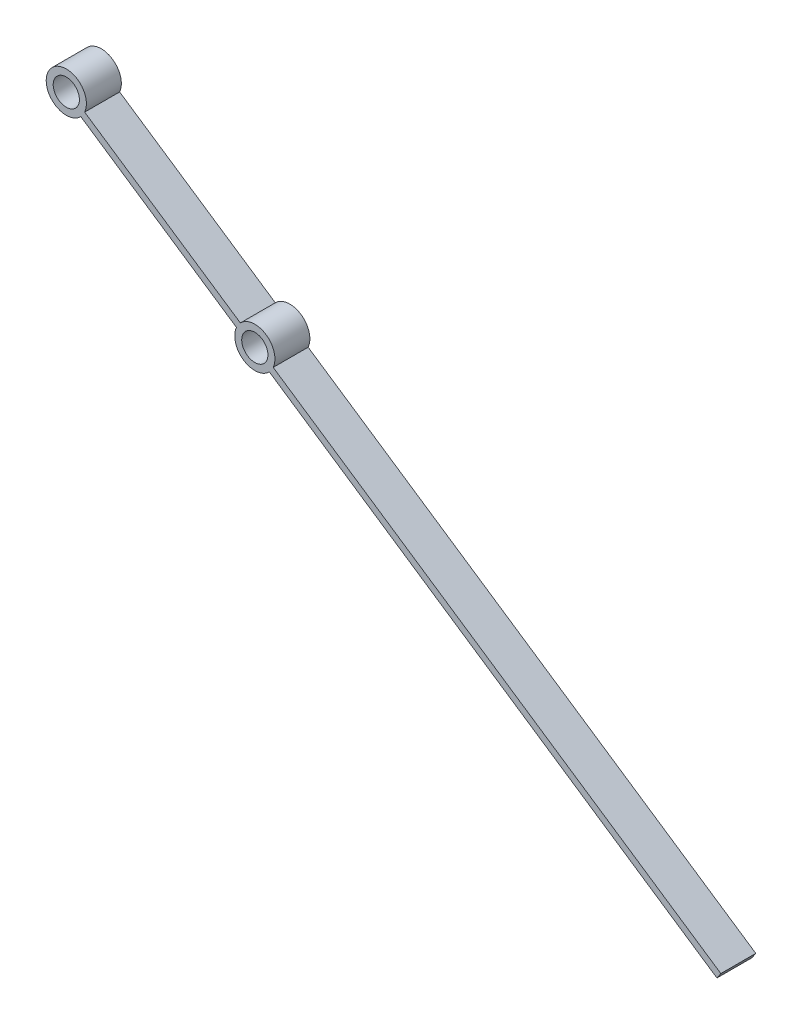
ISO-10303-21;
HEADER;
FILE_DESCRIPTION(('STEP AP214'),'2;1');
FILE_NAME('part.step','',(''),(''),'','','');
FILE_SCHEMA(('AUTOMOTIVE_DESIGN { 1 0 10303 214 1 1 1 1 }'));
ENDSEC;
DATA;
#1=APPLICATION_CONTEXT('core data for automotive mechanical design processes');
#2=APPLICATION_PROTOCOL_DEFINITION('international standard','automotive_design',2000,#1);
#3=PRODUCT_CONTEXT('',#1,'mechanical');
#4=PRODUCT('Part','Part','',(#3));
#5=PRODUCT_RELATED_PRODUCT_CATEGORY('part','',(#4));
#6=PRODUCT_DEFINITION_FORMATION('','',#4);
#7=PRODUCT_DEFINITION_CONTEXT('part definition',#1,'design');
#8=PRODUCT_DEFINITION('design','',#6,#7);
#9=PRODUCT_DEFINITION_SHAPE('','',#8);
#10=(LENGTH_UNIT() NAMED_UNIT(*) SI_UNIT(.MILLI.,.METRE.));
#11=(NAMED_UNIT(*) PLANE_ANGLE_UNIT() SI_UNIT($,.RADIAN.));
#12=(NAMED_UNIT(*) SI_UNIT($,.STERADIAN.) SOLID_ANGLE_UNIT());
#13=UNCERTAINTY_MEASURE_WITH_UNIT(LENGTH_MEASURE(1.E-05),#10,'distance_accuracy_value','');
#14=(GEOMETRIC_REPRESENTATION_CONTEXT(3) GLOBAL_UNCERTAINTY_ASSIGNED_CONTEXT((#13)) GLOBAL_UNIT_ASSIGNED_CONTEXT((#10,
#11,#12)) REPRESENTATION_CONTEXT('',''));
#15=CARTESIAN_POINT('',(0.,0.,0.));
#16=DIRECTION('',(0.,0.,1.));
#17=DIRECTION('',(1.,0.,0.));
#18=AXIS2_PLACEMENT_3D('',#15,#16,#17);
#19=CARTESIAN_POINT('',(-163.126236957769,-95.5245066159686,0.));
#20=DIRECTION('',(0.,0.,1.));
#21=DIRECTION('',(1.,0.,0.));
#22=AXIS2_PLACEMENT_3D('',#19,#20,#21);
#23=CYLINDRICAL_SURFACE('',#22,5.75000000000001);
#24=CARTESIAN_POINT('',(-163.126236957769,-95.5245066159686,0.));
#25=DIRECTION('',(0.,0.,1.));
#26=DIRECTION('',(1.,0.,0.));
#27=AXIS2_PLACEMENT_3D('',#24,#25,#26);
#28=CIRCLE('',#27,5.75000000000001);
#29=CARTESIAN_POINT('',(-168.382718756471,-93.1938631211545,0.));
#30=VERTEX_POINT('',#29);
#31=CARTESIAN_POINT('',(-158.986032584176,-99.5146454287014,0.));
#32=VERTEX_POINT('',#31);
#33=EDGE_CURVE('E132',#30,#32,#28,.T.);
#34=ORIENTED_EDGE('',*,*,#33,.T.);
#35=DIRECTION('',(0.,0.,1.));
#36=VECTOR('',#35,1.);
#37=CARTESIAN_POINT('',(-158.986032584176,-99.5146454287014,0.));
#38=LINE('',#37,#36);
#39=CARTESIAN_POINT('',(-158.986032584176,-99.5146454287014,10.));
#40=VERTEX_POINT('',#39);
#41=EDGE_CURVE('E11',#32,#40,#38,.T.);
#42=ORIENTED_EDGE('',*,*,#41,.T.);
#43=CARTESIAN_POINT('',(-163.126236957769,-95.5245066159686,10.));
#44=DIRECTION('',(0.,0.,1.));
#45=DIRECTION('',(1.,0.,0.));
#46=AXIS2_PLACEMENT_3D('',#43,#44,#45);
#47=CIRCLE('',#46,5.75000000000001);
#48=CARTESIAN_POINT('',(-168.382718756471,-93.1938631211545,10.));
#49=VERTEX_POINT('',#48);
#50=EDGE_CURVE('E135',#49,#40,#47,.T.);
#51=ORIENTED_EDGE('',*,*,#50,.F.);
#52=DIRECTION('',(0.,0.,1.));
#53=VECTOR('',#52,1.);
#54=CARTESIAN_POINT('',(-168.382718756471,-93.1938631211545,0.));
#55=LINE('',#54,#53);
#56=EDGE_CURVE('E138',#30,#49,#55,.T.);
#57=ORIENTED_EDGE('',*,*,#56,.F.);
#58=EDGE_LOOP('',(#34,#42,#51,#57));
#59=FACE_BOUND('',#58,.T.);
#60=ADVANCED_FACE('F35',(#59),#23,.T.);
#61=CARTESIAN_POINT('',(-217.059834790128,-59.2454902999577,10.));
#62=DIRECTION('',(0.,0.,-1.));
#63=DIRECTION('',(-1.,0.,0.));
#64=AXIS2_PLACEMENT_3D('',#61,#62,#63);
#65=CYLINDRICAL_SURFACE('',#64,3.75000000000001);
#66=CARTESIAN_POINT('',(-217.059834790128,-59.2454902999577,0.));
#67=DIRECTION('',(0.,0.,1.));
#68=DIRECTION('',(1.,0.,0.));
#69=AXIS2_PLACEMENT_3D('',#66,#67,#68);
#70=CIRCLE('',#69,3.75000000000001);
#71=CARTESIAN_POINT('',(-213.309834790128,-59.2454902999577,0.));
#72=VERTEX_POINT('',#71);
#73=EDGE_CURVE('E161',#72,#72,#70,.T.);
#74=ORIENTED_EDGE('',*,*,#73,.F.);
#75=EDGE_LOOP('',(#74));
#76=FACE_BOUND('',#75,.T.);
#77=CARTESIAN_POINT('',(-217.059834790128,-59.2454902999577,10.));
#78=DIRECTION('',(0.,0.,1.));
#79=DIRECTION('',(1.,0.,0.));
#80=AXIS2_PLACEMENT_3D('',#77,#78,#79);
#81=CIRCLE('',#80,3.75000000000001);
#82=CARTESIAN_POINT('',(-213.309834790128,-59.2454902999577,10.));
#83=VERTEX_POINT('',#82);
#84=EDGE_CURVE('E156',#83,#83,#81,.T.);
#85=ORIENTED_EDGE('',*,*,#84,.T.);
#86=EDGE_LOOP('',(#85));
#87=FACE_BOUND('',#86,.T.);
#88=ADVANCED_FACE('F204',(#76,#87),#65,.F.);
#89=CARTESIAN_POINT('',(-214.619092814537,-62.0924674000745,10.));
#90=DIRECTION('',(0.558138712554013,0.829747658959367,0.));
#91=DIRECTION('',(-0.829747658959367,0.558138712554013,0.));
#92=AXIS2_PLACEMENT_3D('',#89,#90,#91);
#93=PLANE('',#92);
#94=DIRECTION('',(0.829747658959367,-0.558138712554013,0.));
#95=VECTOR('',#94,1.);
#96=CARTESIAN_POINT('',(-214.619092814537,-62.0924674000745,0.));
#97=LINE('',#96,#95);
#98=CARTESIAN_POINT('',(-212.919630416534,-63.2356291126906,0.));
#99=VERTEX_POINT('',#98);
#100=EDGE_CURVE('E152',#99,#30,#97,.T.);
#101=ORIENTED_EDGE('',*,*,#100,.T.);
#102=ORIENTED_EDGE('',*,*,#56,.T.);
#103=DIRECTION('',(0.829747658959367,-0.558138712554013,0.));
#104=VECTOR('',#103,1.);
#105=CARTESIAN_POINT('',(-214.619092814537,-62.0924674000745,10.));
#106=LINE('',#105,#104);
#107=CARTESIAN_POINT('',(-212.919630416534,-63.2356291126906,10.));
#108=VERTEX_POINT('',#107);
#109=EDGE_CURVE('E151',#108,#49,#106,.T.);
#110=ORIENTED_EDGE('',*,*,#109,.F.);
#111=DIRECTION('',(0.,0.,1.));
#112=VECTOR('',#111,1.);
#113=CARTESIAN_POINT('',(-212.919630416534,-63.2356291126906,0.));
#114=LINE('',#113,#112);
#115=EDGE_CURVE('E148',#108,#99,#114,.F.);
#116=ORIENTED_EDGE('',*,*,#115,.T.);
#117=EDGE_LOOP('',(#101,#102,#110,#116));
#118=FACE_BOUND('',#117,.T.);
#119=ADVANCED_FACE('F183',(#118),#93,.F.);
#120=CARTESIAN_POINT('',(-163.126236957769,-95.5245066159686,10.));
#121=DIRECTION('',(0.,0.,-1.));
#122=DIRECTION('',(-1.,0.,0.));
#123=AXIS2_PLACEMENT_3D('',#120,#121,#122);
#124=CYLINDRICAL_SURFACE('',#123,3.75000000000001);
#125=CARTESIAN_POINT('',(-163.126236957769,-95.5245066159686,0.));
#126=DIRECTION('',(0.,0.,1.));
#127=DIRECTION('',(1.,0.,0.));
#128=AXIS2_PLACEMENT_3D('',#125,#126,#127);
#129=CIRCLE('',#128,3.75000000000001);
#130=CARTESIAN_POINT('',(-159.376236957769,-95.5245066159686,0.));
#131=VERTEX_POINT('',#130);
#132=EDGE_CURVE('E155',#131,#131,#129,.T.);
#133=ORIENTED_EDGE('',*,*,#132,.F.);
#134=EDGE_LOOP('',(#133));
#135=FACE_BOUND('',#134,.T.);
#136=CARTESIAN_POINT('',(-163.126236957769,-95.5245066159686,10.));
#137=DIRECTION('',(0.,0.,1.));
#138=DIRECTION('',(1.,0.,0.));
#139=AXIS2_PLACEMENT_3D('',#136,#137,#138);
#140=CIRCLE('',#139,3.75000000000001);
#141=CARTESIAN_POINT('',(-159.376236957769,-95.5245066159686,10.));
#142=VERTEX_POINT('',#141);
#143=EDGE_CURVE('E166',#142,#142,#140,.T.);
#144=ORIENTED_EDGE('',*,*,#143,.T.);
#145=EDGE_LOOP('',(#144));
#146=FACE_BOUND('',#145,.T.);
#147=ADVANCED_FACE('F215',(#135,#146),#124,.F.);
#148=CARTESIAN_POINT('',(-213.502815389429,-60.4329720821558,10.));
#149=DIRECTION('',(0.558138712554013,0.829747658959366,0.));
#150=DIRECTION('',(-0.829747658959366,0.558138712554013,0.));
#151=AXIS2_PLACEMENT_3D('',#148,#149,#150);
#152=PLANE('',#151);
#153=DIRECTION('',(0.,0.,1.));
#154=VECTOR('',#153,1.);
#155=CARTESIAN_POINT('',(-167.266441331363,-91.5343678032358,0.));
#156=LINE('',#155,#154);
#157=CARTESIAN_POINT('',(-167.266441331363,-91.5343678032358,0.));
#158=VERTEX_POINT('',#157);
#159=CARTESIAN_POINT('',(-167.266441331363,-91.5343678032358,10.));
#160=VERTEX_POINT('',#159);
#161=EDGE_CURVE('E134',#158,#160,#156,.T.);
#162=ORIENTED_EDGE('',*,*,#161,.F.);
#163=DIRECTION('',(0.829747658959366,-0.558138712554013,0.));
#164=VECTOR('',#163,1.);
#165=CARTESIAN_POINT('',(-213.502815389429,-60.4329720821558,0.));
#166=LINE('',#165,#164);
#167=CARTESIAN_POINT('',(-211.803352991426,-61.5761337947719,0.));
#168=VERTEX_POINT('',#167);
#169=EDGE_CURVE('E159',#168,#158,#166,.T.);
#170=ORIENTED_EDGE('',*,*,#169,.F.);
#171=DIRECTION('',(0.,0.,1.));
#172=VECTOR('',#171,1.);
#173=CARTESIAN_POINT('',(-211.803352991426,-61.5761337947719,0.));
#174=LINE('',#173,#172);
#175=CARTESIAN_POINT('',(-211.803352991426,-61.5761337947719,10.));
#176=VERTEX_POINT('',#175);
#177=EDGE_CURVE('E144',#176,#168,#174,.F.);
#178=ORIENTED_EDGE('',*,*,#177,.F.);
#179=DIRECTION('',(0.829747658959366,-0.558138712554013,0.));
#180=VECTOR('',#179,1.);
#181=CARTESIAN_POINT('',(-213.502815389429,-60.4329720821558,10.));
#182=LINE('',#181,#180);
#183=EDGE_CURVE('E169',#176,#160,#182,.T.);
#184=ORIENTED_EDGE('',*,*,#183,.T.);
#185=EDGE_LOOP('',(#162,#170,#178,#184));
#186=FACE_BOUND('',#185,.T.);
#187=ADVANCED_FACE('F192',(#186),#152,.T.);
#188=CARTESIAN_POINT('',(-217.059834790128,-59.2454902999577,10.));
#189=DIRECTION('',(0.,0.,1.));
#190=DIRECTION('',(1.,0.,0.));
#191=AXIS2_PLACEMENT_3D('',#188,#189,#190);
#192=PLANE('',#191);
#193=ORIENTED_EDGE('',*,*,#143,.F.);
#194=EDGE_LOOP('',(#193));
#195=FACE_BOUND('',#194,.T.);
#196=ORIENTED_EDGE('',*,*,#50,.T.);
#197=DIRECTION('',(0.829747658959366,-0.558138712554013,0.));
#198=VECTOR('',#197,1.);
#199=CARTESIAN_POINT('',(-160.685494982178,-98.3714837160853,10.));
#200=LINE('',#199,#198);
#201=CARTESIAN_POINT('',(-30.9247502368244,-185.65644828357,10.));
#202=VERTEX_POINT('',#201);
#203=EDGE_CURVE('E110',#40,#202,#200,.T.);
#204=ORIENTED_EDGE('',*,*,#203,.T.);
#205=DIRECTION('',(0.558138712554029,0.829747658959356,0.));
#206=VECTOR('',#205,1.);
#207=CARTESIAN_POINT('',(-30.9247502368244,-185.65644828357,10.));
#208=LINE('',#207,#206);
#209=CARTESIAN_POINT('',(-29.8084728117164,-183.996952965651,10.));
#210=VERTEX_POINT('',#209);
#211=EDGE_CURVE('E129',#202,#210,#208,.T.);
#212=ORIENTED_EDGE('',*,*,#211,.T.);
#213=DIRECTION('',(0.829747658959367,-0.558138712554013,0.));
#214=VECTOR('',#213,1.);
#215=CARTESIAN_POINT('',(-159.56921755707,-96.7119883981667,10.));
#216=LINE('',#215,#214);
#217=CARTESIAN_POINT('',(-157.869755159068,-97.8551501107828,10.));
#218=VERTEX_POINT('',#217);
#219=EDGE_CURVE('E116',#218,#210,#216,.T.);
#220=ORIENTED_EDGE('',*,*,#219,.F.);
#221=EDGE_CURVE('E50',#218,#160,#47,.T.);
#222=ORIENTED_EDGE('',*,*,#221,.T.);
#223=ORIENTED_EDGE('',*,*,#183,.F.);
#224=CARTESIAN_POINT('',(-217.059834790128,-59.2454902999577,10.));
#225=DIRECTION('',(0.,0.,1.));
#226=DIRECTION('',(1.,0.,0.));
#227=AXIS2_PLACEMENT_3D('',#224,#225,#226);
#228=CIRCLE('',#227,5.75000000000003);
#229=EDGE_CURVE('E141',#176,#108,#228,.T.);
#230=ORIENTED_EDGE('',*,*,#229,.T.);
#231=ORIENTED_EDGE('',*,*,#109,.T.);
#232=EDGE_LOOP('',(#196,#204,#212,#220,#222,#223,#230,#231));
#233=FACE_BOUND('',#232,.T.);
#234=ORIENTED_EDGE('',*,*,#84,.F.);
#235=EDGE_LOOP('',(#234));
#236=FACE_BOUND('',#235,.T.);
#237=ADVANCED_FACE('F37',(#195,#233,#236),#192,.T.);
#238=CARTESIAN_POINT('',(-217.059834790128,-59.2454902999577,0.));
#239=DIRECTION('',(0.,0.,1.));
#240=DIRECTION('',(1.,0.,0.));
#241=AXIS2_PLACEMENT_3D('',#238,#239,#240);
#242=PLANE('',#241);
#243=ORIENTED_EDGE('',*,*,#132,.T.);
#244=EDGE_LOOP('',(#243));
#245=FACE_BOUND('',#244,.T.);
#246=DIRECTION('',(0.829747658959366,-0.558138712554013,0.));
#247=VECTOR('',#246,1.);
#248=CARTESIAN_POINT('',(-160.685494982178,-98.3714837160853,0.));
#249=LINE('',#248,#247);
#250=CARTESIAN_POINT('',(-30.9247502368244,-185.65644828357,0.));
#251=VERTEX_POINT('',#250);
#252=EDGE_CURVE('E124',#32,#251,#249,.T.);
#253=ORIENTED_EDGE('',*,*,#252,.F.);
#254=ORIENTED_EDGE('',*,*,#33,.F.);
#255=ORIENTED_EDGE('',*,*,#100,.F.);
#256=CARTESIAN_POINT('',(-217.059834790128,-59.2454902999577,0.));
#257=DIRECTION('',(0.,0.,1.));
#258=DIRECTION('',(1.,0.,0.));
#259=AXIS2_PLACEMENT_3D('',#256,#257,#258);
#260=CIRCLE('',#259,5.75000000000003);
#261=EDGE_CURVE('E142',#168,#99,#260,.T.);
#262=ORIENTED_EDGE('',*,*,#261,.F.);
#263=ORIENTED_EDGE('',*,*,#169,.T.);
#264=CARTESIAN_POINT('',(-157.869755159068,-97.8551501107828,0.));
#265=VERTEX_POINT('',#264);
#266=EDGE_CURVE('E108',#265,#158,#28,.T.);
#267=ORIENTED_EDGE('',*,*,#266,.F.);
#268=DIRECTION('',(0.829747658959367,-0.558138712554013,0.));
#269=VECTOR('',#268,1.);
#270=CARTESIAN_POINT('',(-159.56921755707,-96.7119883981667,0.));
#271=LINE('',#270,#269);
#272=CARTESIAN_POINT('',(-29.8084728117164,-183.996952965651,0.));
#273=VERTEX_POINT('',#272);
#274=EDGE_CURVE('E99',#265,#273,#271,.T.);
#275=ORIENTED_EDGE('',*,*,#274,.T.);
#276=DIRECTION('',(0.558138712554029,0.829747658959356,0.));
#277=VECTOR('',#276,1.);
#278=CARTESIAN_POINT('',(-30.9247502368244,-185.65644828357,0.));
#279=LINE('',#278,#277);
#280=EDGE_CURVE('E105',#251,#273,#279,.T.);
#281=ORIENTED_EDGE('',*,*,#280,.F.);
#282=EDGE_LOOP('',(#253,#254,#255,#262,#263,#267,#275,#281));
#283=FACE_BOUND('',#282,.T.);
#284=ORIENTED_EDGE('',*,*,#73,.T.);
#285=EDGE_LOOP('',(#284));
#286=FACE_BOUND('',#285,.T.);
#287=ADVANCED_FACE('F102',(#245,#283,#286),#242,.F.);
#288=CARTESIAN_POINT('',(-217.059834790128,-59.2454902999577,0.));
#289=DIRECTION('',(0.,0.,1.));
#290=DIRECTION('',(1.,0.,0.));
#291=AXIS2_PLACEMENT_3D('',#288,#289,#290);
#292=CYLINDRICAL_SURFACE('',#291,5.75000000000003);
#293=ORIENTED_EDGE('',*,*,#115,.F.);
#294=ORIENTED_EDGE('',*,*,#229,.F.);
#295=ORIENTED_EDGE('',*,*,#177,.T.);
#296=ORIENTED_EDGE('',*,*,#261,.T.);
#297=EDGE_LOOP('',(#293,#294,#295,#296));
#298=FACE_BOUND('',#297,.T.);
#299=ADVANCED_FACE('F188',(#298),#292,.T.);
#300=DIRECTION('',(0.,0.,1.));
#301=VECTOR('',#300,1.);
#302=CARTESIAN_POINT('',(-157.869755159068,-97.8551501107828,0.));
#303=LINE('',#302,#301);
#304=EDGE_CURVE('E43',#265,#218,#303,.T.);
#305=ORIENTED_EDGE('',*,*,#304,.F.);
#306=ORIENTED_EDGE('',*,*,#266,.T.);
#307=ORIENTED_EDGE('',*,*,#161,.T.);
#308=ORIENTED_EDGE('',*,*,#221,.F.);
#309=EDGE_LOOP('',(#305,#306,#307,#308));
#310=FACE_BOUND('',#309,.T.);
#311=ADVANCED_FACE('F193',(#310),#23,.T.);
#312=CARTESIAN_POINT('',(-160.685494982178,-98.3714837160853,10.));
#313=DIRECTION('',(0.558138712554013,0.829747658959366,0.));
#314=DIRECTION('',(-0.829747658959366,0.558138712554013,0.));
#315=AXIS2_PLACEMENT_3D('',#312,#313,#314);
#316=PLANE('',#315);
#317=ORIENTED_EDGE('',*,*,#41,.F.);
#318=ORIENTED_EDGE('',*,*,#252,.T.);
#319=DIRECTION('',(0.,0.,-1.));
#320=VECTOR('',#319,1.);
#321=CARTESIAN_POINT('',(-30.9247502368244,-185.65644828357,10.));
#322=LINE('',#321,#320);
#323=EDGE_CURVE('E120',#202,#251,#322,.T.);
#324=ORIENTED_EDGE('',*,*,#323,.F.);
#325=ORIENTED_EDGE('',*,*,#203,.F.);
#326=EDGE_LOOP('',(#317,#318,#324,#325));
#327=FACE_BOUND('',#326,.T.);
#328=ADVANCED_FACE('F177',(#327),#316,.F.);
#329=CARTESIAN_POINT('',(-30.9247502368244,-185.65644828357,10.));
#330=DIRECTION('',(-0.829747658959356,0.558138712554029,0.));
#331=DIRECTION('',(-0.558138712554029,-0.829747658959356,0.));
#332=AXIS2_PLACEMENT_3D('',#329,#330,#331);
#333=PLANE('',#332);
#334=ORIENTED_EDGE('',*,*,#280,.T.);
#335=DIRECTION('',(0.,0.,-1.));
#336=VECTOR('',#335,1.);
#337=CARTESIAN_POINT('',(-29.8084728117164,-183.996952965651,10.));
#338=LINE('',#337,#336);
#339=EDGE_CURVE('E113',#210,#273,#338,.T.);
#340=ORIENTED_EDGE('',*,*,#339,.F.);
#341=ORIENTED_EDGE('',*,*,#211,.F.);
#342=ORIENTED_EDGE('',*,*,#323,.T.);
#343=EDGE_LOOP('',(#334,#340,#341,#342));
#344=FACE_BOUND('',#343,.T.);
#345=ADVANCED_FACE('F122',(#344),#333,.F.);
#346=CARTESIAN_POINT('',(-159.56921755707,-96.7119883981667,10.));
#347=DIRECTION('',(0.558138712554013,0.829747658959366,0.));
#348=DIRECTION('',(-0.829747658959366,0.558138712554013,0.));
#349=AXIS2_PLACEMENT_3D('',#346,#347,#348);
#350=PLANE('',#349);
#351=ORIENTED_EDGE('',*,*,#274,.F.);
#352=ORIENTED_EDGE('',*,*,#304,.T.);
#353=ORIENTED_EDGE('',*,*,#219,.T.);
#354=ORIENTED_EDGE('',*,*,#339,.T.);
#355=EDGE_LOOP('',(#351,#352,#353,#354));
#356=FACE_BOUND('',#355,.T.);
#357=ADVANCED_FACE('F114',(#356),#350,.T.);
#358=CLOSED_SHELL('',(#60,#88,#119,#147,#187,#237,#287,#299,#311,#328,#345,#357));
#359=MANIFOLD_SOLID_BREP('B2',#358);
#360=ADVANCED_BREP_SHAPE_REPRESENTATION('',(#18,#359),#14);
#361=SHAPE_DEFINITION_REPRESENTATION(#9,#360);
ENDSEC;
END-ISO-10303-21;
